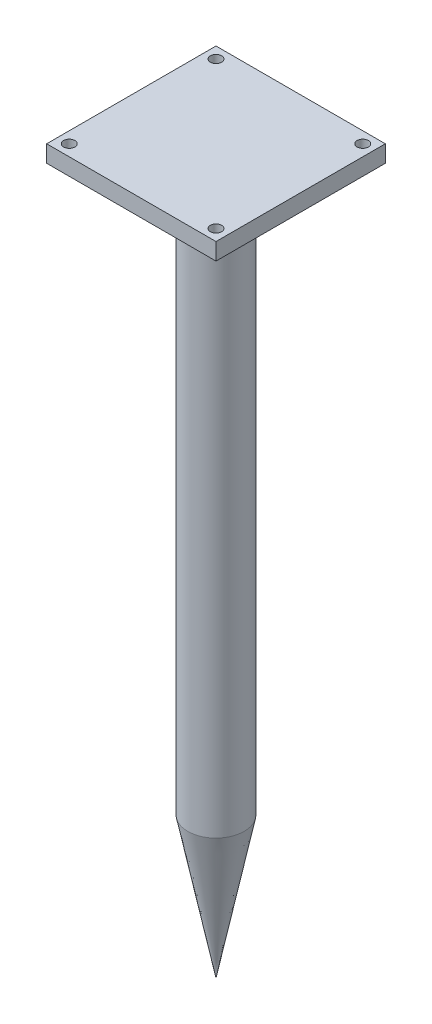
ISO-10303-21;
HEADER;
FILE_DESCRIPTION(('STEP AP214'),'2;1');
FILE_NAME('part.step','',(''),(''),'','','');
FILE_SCHEMA(('AUTOMOTIVE_DESIGN { 1 0 10303 214 1 1 1 1 }'));
ENDSEC;
DATA;
#1=APPLICATION_CONTEXT('core data for automotive mechanical design processes');
#2=APPLICATION_PROTOCOL_DEFINITION('international standard','automotive_design',2000,#1);
#3=PRODUCT_CONTEXT('',#1,'mechanical');
#4=PRODUCT('Part','Part','',(#3));
#5=PRODUCT_RELATED_PRODUCT_CATEGORY('part','',(#4));
#6=PRODUCT_DEFINITION_FORMATION('','',#4);
#7=PRODUCT_DEFINITION_CONTEXT('part definition',#1,'design');
#8=PRODUCT_DEFINITION('design','',#6,#7);
#9=PRODUCT_DEFINITION_SHAPE('','',#8);
#10=(LENGTH_UNIT() NAMED_UNIT(*) SI_UNIT(.MILLI.,.METRE.));
#11=(NAMED_UNIT(*) PLANE_ANGLE_UNIT() SI_UNIT($,.RADIAN.));
#12=(NAMED_UNIT(*) SI_UNIT($,.STERADIAN.) SOLID_ANGLE_UNIT());
#13=UNCERTAINTY_MEASURE_WITH_UNIT(LENGTH_MEASURE(1.E-05),#10,'distance_accuracy_value','');
#14=(GEOMETRIC_REPRESENTATION_CONTEXT(3) GLOBAL_UNCERTAINTY_ASSIGNED_CONTEXT((#13)) GLOBAL_UNIT_ASSIGNED_CONTEXT((#10,
#11,#12)) REPRESENTATION_CONTEXT('',''));
#15=CARTESIAN_POINT('',(0.,0.,0.));
#16=DIRECTION('',(0.,0.,1.));
#17=DIRECTION('',(1.,0.,0.));
#18=AXIS2_PLACEMENT_3D('',#15,#16,#17);
#19=CARTESIAN_POINT('',(0.,100.,0.));
#20=DIRECTION('',(0.,-1.,0.));
#21=DIRECTION('',(0.,0.,-1.));
#22=AXIS2_PLACEMENT_3D('',#19,#20,#21);
#23=CYLINDRICAL_SURFACE('',#22,5.);
#24=CARTESIAN_POINT('',(0.,100.,0.));
#25=DIRECTION('',(0.,1.,0.));
#26=DIRECTION('',(0.,0.,1.));
#27=AXIS2_PLACEMENT_3D('',#24,#25,#26);
#28=CIRCLE('',#27,5.);
#29=CARTESIAN_POINT('',(0.,100.,5.));
#30=VERTEX_POINT('',#29);
#31=EDGE_CURVE('E11',#30,#30,#28,.T.);
#32=ORIENTED_EDGE('',*,*,#31,.F.);
#33=EDGE_LOOP('',(#32));
#34=FACE_BOUND('',#33,.T.);
#35=CARTESIAN_POINT('',(0.,0.,0.));
#36=DIRECTION('',(0.,1.,0.));
#37=DIRECTION('',(0.,0.,1.));
#38=AXIS2_PLACEMENT_3D('',#35,#36,#37);
#39=CIRCLE('',#38,5.);
#40=CARTESIAN_POINT('',(0.,0.,5.));
#41=VERTEX_POINT('',#40);
#42=EDGE_CURVE('E120',#41,#41,#39,.T.);
#43=ORIENTED_EDGE('',*,*,#42,.T.);
#44=EDGE_LOOP('',(#43));
#45=FACE_BOUND('',#44,.T.);
#46=ADVANCED_FACE('F43',(#34,#45),#23,.T.);
#47=CARTESIAN_POINT('',(15.,103.,-15.));
#48=DIRECTION('',(-1.,0.,0.));
#49=DIRECTION('',(0.,0.,1.));
#50=AXIS2_PLACEMENT_3D('',#47,#48,#49);
#51=PLANE('',#50);
#52=DIRECTION('',(0.,0.,-1.));
#53=VECTOR('',#52,1.);
#54=CARTESIAN_POINT('',(15.,100.,-15.));
#55=LINE('',#54,#53);
#56=CARTESIAN_POINT('',(15.,100.,15.));
#57=VERTEX_POINT('',#56);
#58=CARTESIAN_POINT('',(15.,100.,-15.));
#59=VERTEX_POINT('',#58);
#60=EDGE_CURVE('E156',#57,#59,#55,.T.);
#61=ORIENTED_EDGE('',*,*,#60,.T.);
#62=DIRECTION('',(0.,-1.,0.));
#63=VECTOR('',#62,1.);
#64=CARTESIAN_POINT('',(15.,103.,-15.));
#65=LINE('',#64,#63);
#66=CARTESIAN_POINT('',(15.,103.,-15.));
#67=VERTEX_POINT('',#66);
#68=EDGE_CURVE('E52',#67,#59,#65,.T.);
#69=ORIENTED_EDGE('',*,*,#68,.F.);
#70=DIRECTION('',(0.,0.,-1.));
#71=VECTOR('',#70,1.);
#72=CARTESIAN_POINT('',(15.,103.,-15.));
#73=LINE('',#72,#71);
#74=CARTESIAN_POINT('',(15.,103.,15.));
#75=VERTEX_POINT('',#74);
#76=EDGE_CURVE('E157',#75,#67,#73,.T.);
#77=ORIENTED_EDGE('',*,*,#76,.F.);
#78=DIRECTION('',(0.,-1.,0.));
#79=VECTOR('',#78,1.);
#80=CARTESIAN_POINT('',(15.,103.,15.));
#81=LINE('',#80,#79);
#82=EDGE_CURVE('E167',#75,#57,#81,.T.);
#83=ORIENTED_EDGE('',*,*,#82,.T.);
#84=EDGE_LOOP('',(#61,#69,#77,#83));
#85=FACE_BOUND('',#84,.T.);
#86=ADVANCED_FACE('F110',(#85),#51,.F.);
#87=CARTESIAN_POINT('',(-15.,103.,-15.));
#88=DIRECTION('',(0.,0.,1.));
#89=DIRECTION('',(1.,0.,0.));
#90=AXIS2_PLACEMENT_3D('',#87,#88,#89);
#91=PLANE('',#90);
#92=DIRECTION('',(-1.,0.,0.));
#93=VECTOR('',#92,1.);
#94=CARTESIAN_POINT('',(-15.,100.,-15.));
#95=LINE('',#94,#93);
#96=CARTESIAN_POINT('',(-15.,100.,-15.));
#97=VERTEX_POINT('',#96);
#98=EDGE_CURVE('E171',#59,#97,#95,.T.);
#99=ORIENTED_EDGE('',*,*,#98,.T.);
#100=DIRECTION('',(0.,-1.,0.));
#101=VECTOR('',#100,1.);
#102=CARTESIAN_POINT('',(-15.,103.,-15.));
#103=LINE('',#102,#101);
#104=CARTESIAN_POINT('',(-15.,103.,-15.));
#105=VERTEX_POINT('',#104);
#106=EDGE_CURVE('E183',#105,#97,#103,.T.);
#107=ORIENTED_EDGE('',*,*,#106,.F.);
#108=DIRECTION('',(-1.,0.,0.));
#109=VECTOR('',#108,1.);
#110=CARTESIAN_POINT('',(-15.,103.,-15.));
#111=LINE('',#110,#109);
#112=EDGE_CURVE('E92',#67,#105,#111,.T.);
#113=ORIENTED_EDGE('',*,*,#112,.F.);
#114=ORIENTED_EDGE('',*,*,#68,.T.);
#115=EDGE_LOOP('',(#99,#107,#113,#114));
#116=FACE_BOUND('',#115,.T.);
#117=ADVANCED_FACE('F115',(#116),#91,.F.);
#118=CARTESIAN_POINT('',(-15.,103.,-15.));
#119=DIRECTION('',(1.,0.,0.));
#120=DIRECTION('',(0.,0.,-1.));
#121=AXIS2_PLACEMENT_3D('',#118,#119,#120);
#122=PLANE('',#121);
#123=DIRECTION('',(0.,0.,1.));
#124=VECTOR('',#123,1.);
#125=CARTESIAN_POINT('',(-15.,100.,-15.));
#126=LINE('',#125,#124);
#127=CARTESIAN_POINT('',(-15.,100.,15.));
#128=VERTEX_POINT('',#127);
#129=EDGE_CURVE('E78',#97,#128,#126,.T.);
#130=ORIENTED_EDGE('',*,*,#129,.T.);
#131=DIRECTION('',(0.,-1.,0.));
#132=VECTOR('',#131,1.);
#133=CARTESIAN_POINT('',(-15.,103.,15.));
#134=LINE('',#133,#132);
#135=CARTESIAN_POINT('',(-15.,103.,15.));
#136=VERTEX_POINT('',#135);
#137=EDGE_CURVE('E180',#136,#128,#134,.T.);
#138=ORIENTED_EDGE('',*,*,#137,.F.);
#139=DIRECTION('',(0.,0.,1.));
#140=VECTOR('',#139,1.);
#141=CARTESIAN_POINT('',(-15.,103.,-15.));
#142=LINE('',#141,#140);
#143=EDGE_CURVE('E162',#105,#136,#142,.T.);
#144=ORIENTED_EDGE('',*,*,#143,.F.);
#145=ORIENTED_EDGE('',*,*,#106,.T.);
#146=EDGE_LOOP('',(#130,#138,#144,#145));
#147=FACE_BOUND('',#146,.T.);
#148=ADVANCED_FACE('F211',(#147),#122,.F.);
#149=CARTESIAN_POINT('',(-15.,103.,15.));
#150=DIRECTION('',(0.,0.,-1.));
#151=DIRECTION('',(-1.,0.,0.));
#152=AXIS2_PLACEMENT_3D('',#149,#150,#151);
#153=PLANE('',#152);
#154=DIRECTION('',(1.,0.,0.));
#155=VECTOR('',#154,1.);
#156=CARTESIAN_POINT('',(-15.,100.,15.));
#157=LINE('',#156,#155);
#158=EDGE_CURVE('E84',#128,#57,#157,.T.);
#159=ORIENTED_EDGE('',*,*,#158,.T.);
#160=ORIENTED_EDGE('',*,*,#82,.F.);
#161=DIRECTION('',(1.,0.,0.));
#162=VECTOR('',#161,1.);
#163=CARTESIAN_POINT('',(-15.,103.,15.));
#164=LINE('',#163,#162);
#165=EDGE_CURVE('E60',#136,#75,#164,.T.);
#166=ORIENTED_EDGE('',*,*,#165,.F.);
#167=ORIENTED_EDGE('',*,*,#137,.T.);
#168=EDGE_LOOP('',(#159,#160,#166,#167));
#169=FACE_BOUND('',#168,.T.);
#170=ADVANCED_FACE('F203',(#169),#153,.F.);
#171=CARTESIAN_POINT('',(0.,103.,0.));
#172=DIRECTION('',(0.,1.,0.));
#173=DIRECTION('',(0.,0.,1.));
#174=AXIS2_PLACEMENT_3D('',#171,#172,#173);
#175=PLANE('',#174);
#176=CARTESIAN_POINT('',(-13.,103.,13.));
#177=DIRECTION('',(0.,1.,0.));
#178=DIRECTION('',(0.,0.,-1.));
#179=AXIS2_PLACEMENT_3D('',#176,#177,#178);
#180=CIRCLE('',#179,1.);
#181=CARTESIAN_POINT('',(-13.,103.,12.));
#182=VERTEX_POINT('',#181);
#183=EDGE_CURVE('E126',#182,#182,#180,.T.);
#184=ORIENTED_EDGE('',*,*,#183,.F.);
#185=EDGE_LOOP('',(#184));
#186=FACE_BOUND('',#185,.T.);
#187=CARTESIAN_POINT('',(13.,103.,13.));
#188=DIRECTION('',(0.,1.,0.));
#189=DIRECTION('',(0.,0.,1.));
#190=AXIS2_PLACEMENT_3D('',#187,#188,#189);
#191=CIRCLE('',#190,1.);
#192=CARTESIAN_POINT('',(13.,103.,14.));
#193=VERTEX_POINT('',#192);
#194=EDGE_CURVE('E134',#193,#193,#191,.T.);
#195=ORIENTED_EDGE('',*,*,#194,.F.);
#196=EDGE_LOOP('',(#195));
#197=FACE_BOUND('',#196,.T.);
#198=CARTESIAN_POINT('',(13.,103.,-13.));
#199=DIRECTION('',(0.,1.,0.));
#200=DIRECTION('',(0.,0.,-1.));
#201=AXIS2_PLACEMENT_3D('',#198,#199,#200);
#202=CIRCLE('',#201,1.);
#203=CARTESIAN_POINT('',(13.,103.,-14.));
#204=VERTEX_POINT('',#203);
#205=EDGE_CURVE('E133',#204,#204,#202,.T.);
#206=ORIENTED_EDGE('',*,*,#205,.F.);
#207=EDGE_LOOP('',(#206));
#208=FACE_BOUND('',#207,.T.);
#209=CARTESIAN_POINT('',(-13.,103.,-13.));
#210=DIRECTION('',(0.,1.,0.));
#211=DIRECTION('',(0.,0.,1.));
#212=AXIS2_PLACEMENT_3D('',#209,#210,#211);
#213=CIRCLE('',#212,1.);
#214=CARTESIAN_POINT('',(-13.,103.,-12.));
#215=VERTEX_POINT('',#214);
#216=EDGE_CURVE('E138',#215,#215,#213,.T.);
#217=ORIENTED_EDGE('',*,*,#216,.F.);
#218=EDGE_LOOP('',(#217));
#219=FACE_BOUND('',#218,.T.);
#220=ORIENTED_EDGE('',*,*,#76,.T.);
#221=ORIENTED_EDGE('',*,*,#112,.T.);
#222=ORIENTED_EDGE('',*,*,#143,.T.);
#223=ORIENTED_EDGE('',*,*,#165,.T.);
#224=EDGE_LOOP('',(#220,#221,#222,#223));
#225=FACE_BOUND('',#224,.T.);
#226=ADVANCED_FACE('F193',(#186,#197,#208,#219,#225),#175,.T.);
#227=CARTESIAN_POINT('',(0.,100.,0.));
#228=DIRECTION('',(0.,1.,0.));
#229=DIRECTION('',(0.,0.,1.));
#230=AXIS2_PLACEMENT_3D('',#227,#228,#229);
#231=PLANE('',#230);
#232=CARTESIAN_POINT('',(-13.,100.,13.));
#233=DIRECTION('',(0.,1.,0.));
#234=DIRECTION('',(0.,0.,1.));
#235=AXIS2_PLACEMENT_3D('',#232,#233,#234);
#236=CIRCLE('',#235,1.);
#237=CARTESIAN_POINT('',(-13.,100.,14.));
#238=VERTEX_POINT('',#237);
#239=EDGE_CURVE('E122',#238,#238,#236,.F.);
#240=ORIENTED_EDGE('',*,*,#239,.F.);
#241=EDGE_LOOP('',(#240));
#242=FACE_BOUND('',#241,.T.);
#243=CARTESIAN_POINT('',(13.,100.,13.));
#244=DIRECTION('',(0.,1.,0.));
#245=DIRECTION('',(0.,0.,1.));
#246=AXIS2_PLACEMENT_3D('',#243,#244,#245);
#247=CIRCLE('',#246,1.);
#248=CARTESIAN_POINT('',(13.,100.,14.));
#249=VERTEX_POINT('',#248);
#250=EDGE_CURVE('E139',#249,#249,#247,.F.);
#251=ORIENTED_EDGE('',*,*,#250,.F.);
#252=EDGE_LOOP('',(#251));
#253=FACE_BOUND('',#252,.T.);
#254=CARTESIAN_POINT('',(13.,100.,-13.));
#255=DIRECTION('',(0.,1.,0.));
#256=DIRECTION('',(0.,0.,1.));
#257=AXIS2_PLACEMENT_3D('',#254,#255,#256);
#258=CIRCLE('',#257,1.);
#259=CARTESIAN_POINT('',(13.,100.,-12.));
#260=VERTEX_POINT('',#259);
#261=EDGE_CURVE('E129',#260,#260,#258,.F.);
#262=ORIENTED_EDGE('',*,*,#261,.F.);
#263=EDGE_LOOP('',(#262));
#264=FACE_BOUND('',#263,.T.);
#265=CARTESIAN_POINT('',(-13.,100.,-13.));
#266=DIRECTION('',(0.,1.,0.));
#267=DIRECTION('',(0.,0.,1.));
#268=AXIS2_PLACEMENT_3D('',#265,#266,#267);
#269=CIRCLE('',#268,1.);
#270=CARTESIAN_POINT('',(-13.,100.,-12.));
#271=VERTEX_POINT('',#270);
#272=EDGE_CURVE('E152',#271,#271,#269,.F.);
#273=ORIENTED_EDGE('',*,*,#272,.F.);
#274=EDGE_LOOP('',(#273));
#275=FACE_BOUND('',#274,.T.);
#276=ORIENTED_EDGE('',*,*,#31,.T.);
#277=EDGE_LOOP('',(#276));
#278=FACE_BOUND('',#277,.T.);
#279=ORIENTED_EDGE('',*,*,#60,.F.);
#280=ORIENTED_EDGE('',*,*,#158,.F.);
#281=ORIENTED_EDGE('',*,*,#129,.F.);
#282=ORIENTED_EDGE('',*,*,#98,.F.);
#283=EDGE_LOOP('',(#279,#280,#281,#282));
#284=FACE_BOUND('',#283,.T.);
#285=ADVANCED_FACE('F190',(#242,#253,#264,#275,#278,#284),#231,.F.);
#286=CARTESIAN_POINT('',(-13.,97.1715728752538,-13.));
#287=DIRECTION('',(0.,1.,0.));
#288=DIRECTION('',(0.,0.,1.));
#289=AXIS2_PLACEMENT_3D('',#286,#287,#288);
#290=CYLINDRICAL_SURFACE('',#289,1.);
#291=ORIENTED_EDGE('',*,*,#272,.T.);
#292=EDGE_LOOP('',(#291));
#293=FACE_BOUND('',#292,.T.);
#294=ORIENTED_EDGE('',*,*,#216,.T.);
#295=EDGE_LOOP('',(#294));
#296=FACE_BOUND('',#295,.T.);
#297=ADVANCED_FACE('F192',(#293,#296),#290,.F.);
#298=CARTESIAN_POINT('',(13.,97.1715728752538,-13.));
#299=DIRECTION('',(0.,1.,0.));
#300=DIRECTION('',(0.,0.,1.));
#301=AXIS2_PLACEMENT_3D('',#298,#299,#300);
#302=CYLINDRICAL_SURFACE('',#301,1.);
#303=ORIENTED_EDGE('',*,*,#261,.T.);
#304=EDGE_LOOP('',(#303));
#305=FACE_BOUND('',#304,.T.);
#306=ORIENTED_EDGE('',*,*,#205,.T.);
#307=EDGE_LOOP('',(#306));
#308=FACE_BOUND('',#307,.T.);
#309=ADVANCED_FACE('F200',(#305,#308),#302,.F.);
#310=CARTESIAN_POINT('',(13.,97.1715728752538,13.));
#311=DIRECTION('',(0.,1.,0.));
#312=DIRECTION('',(0.,0.,1.));
#313=AXIS2_PLACEMENT_3D('',#310,#311,#312);
#314=CYLINDRICAL_SURFACE('',#313,1.);
#315=ORIENTED_EDGE('',*,*,#250,.T.);
#316=EDGE_LOOP('',(#315));
#317=FACE_BOUND('',#316,.T.);
#318=ORIENTED_EDGE('',*,*,#194,.T.);
#319=EDGE_LOOP('',(#318));
#320=FACE_BOUND('',#319,.T.);
#321=ADVANCED_FACE('F104',(#317,#320),#314,.F.);
#322=CARTESIAN_POINT('',(-13.,97.1715728752538,13.));
#323=DIRECTION('',(0.,1.,0.));
#324=DIRECTION('',(0.,0.,1.));
#325=AXIS2_PLACEMENT_3D('',#322,#323,#324);
#326=CYLINDRICAL_SURFACE('',#325,1.);
#327=ORIENTED_EDGE('',*,*,#239,.T.);
#328=EDGE_LOOP('',(#327));
#329=FACE_BOUND('',#328,.T.);
#330=ORIENTED_EDGE('',*,*,#183,.T.);
#331=EDGE_LOOP('',(#330));
#332=FACE_BOUND('',#331,.T.);
#333=ADVANCED_FACE('F98',(#329,#332),#326,.F.);
#334=CARTESIAN_POINT('',(0.,-25.,0.));
#335=DIRECTION('',(0.,1.,0.));
#336=DIRECTION('',(0.,0.,1.));
#337=AXIS2_PLACEMENT_3D('',#334,#335,#336);
#338=CONICAL_SURFACE('',#337,0.,0.197395559849881);
#339=ORIENTED_EDGE('',*,*,#42,.F.);
#340=EDGE_LOOP('',(#339));
#341=FACE_BOUND('',#340,.T.);
#342=CARTESIAN_POINT('',(0.,-25.,0.));
#343=VERTEX_POINT('',#342);
#344=VERTEX_LOOP('',#343);
#345=FACE_BOUND('',#344,.T.);
#346=ADVANCED_FACE('F96',(#341,#345),#338,.T.);
#347=CLOSED_SHELL('',(#46,#86,#117,#148,#170,#226,#285,#297,#309,#321,#333,#346));
#348=MANIFOLD_SOLID_BREP('B2',#347);
#349=ADVANCED_BREP_SHAPE_REPRESENTATION('',(#18,#348),#14);
#350=SHAPE_DEFINITION_REPRESENTATION(#9,#349);
ENDSEC;
END-ISO-10303-21;
